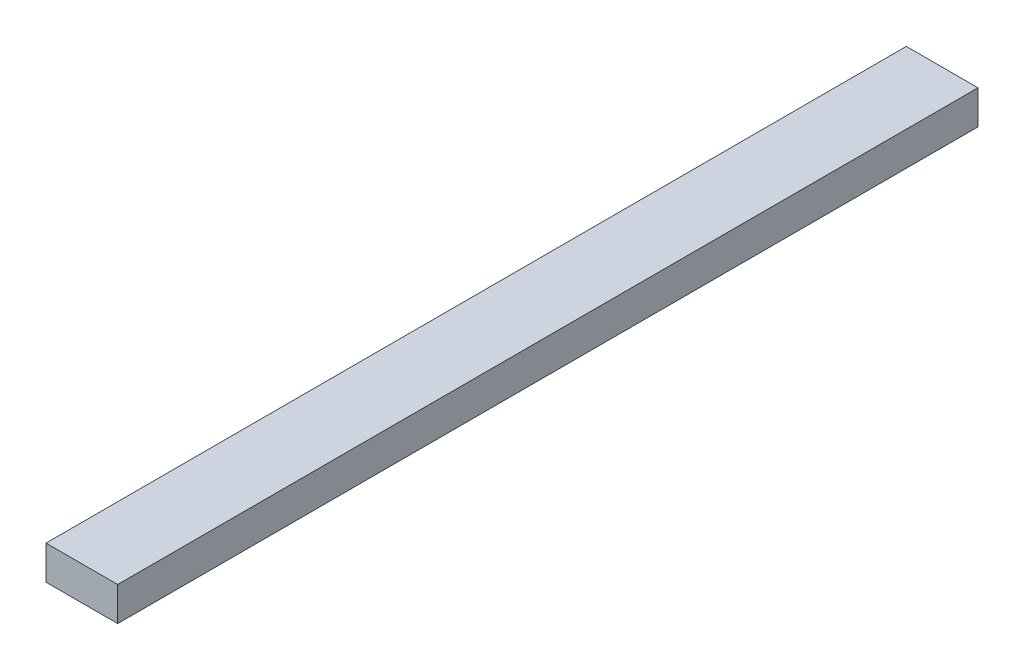
ISO-10303-21;
HEADER;
FILE_DESCRIPTION(('STEP AP214'),'2;1');
FILE_NAME('part.step','',(''),(''),'','','');
FILE_SCHEMA(('AUTOMOTIVE_DESIGN { 1 0 10303 214 1 1 1 1 }'));
ENDSEC;
DATA;
#1=APPLICATION_CONTEXT('core data for automotive mechanical design processes');
#2=APPLICATION_PROTOCOL_DEFINITION('international standard','automotive_design',2000,#1);
#3=PRODUCT_CONTEXT('',#1,'mechanical');
#4=PRODUCT('Part','Part','',(#3));
#5=PRODUCT_RELATED_PRODUCT_CATEGORY('part','',(#4));
#6=PRODUCT_DEFINITION_FORMATION('','',#4);
#7=PRODUCT_DEFINITION_CONTEXT('part definition',#1,'design');
#8=PRODUCT_DEFINITION('design','',#6,#7);
#9=PRODUCT_DEFINITION_SHAPE('','',#8);
#10=(LENGTH_UNIT() NAMED_UNIT(*) SI_UNIT(.MILLI.,.METRE.));
#11=(NAMED_UNIT(*) PLANE_ANGLE_UNIT() SI_UNIT($,.RADIAN.));
#12=(NAMED_UNIT(*) SI_UNIT($,.STERADIAN.) SOLID_ANGLE_UNIT());
#13=UNCERTAINTY_MEASURE_WITH_UNIT(LENGTH_MEASURE(1.E-05),#10,'distance_accuracy_value','');
#14=(GEOMETRIC_REPRESENTATION_CONTEXT(3) GLOBAL_UNCERTAINTY_ASSIGNED_CONTEXT((#13)) GLOBAL_UNIT_ASSIGNED_CONTEXT((#10,
#11,#12)) REPRESENTATION_CONTEXT('',''));
#15=CARTESIAN_POINT('',(0.,0.,0.));
#16=DIRECTION('',(0.,0.,1.));
#17=DIRECTION('',(1.,0.,0.));
#18=AXIS2_PLACEMENT_3D('',#15,#16,#17);
#19=CARTESIAN_POINT('',(-3.175,-1.5,76.2));
#20=DIRECTION('',(1.,0.,0.));
#21=DIRECTION('',(0.,0.,-1.));
#22=AXIS2_PLACEMENT_3D('',#19,#20,#21);
#23=PLANE('',#22);
#24=DIRECTION('',(0.,-1.,0.));
#25=VECTOR('',#24,1.);
#26=CARTESIAN_POINT('',(-3.175,-1.5,0.));
#27=LINE('',#26,#25);
#28=CARTESIAN_POINT('',(-3.175,1.5,0.));
#29=VERTEX_POINT('',#28);
#30=CARTESIAN_POINT('',(-3.175,-1.5,0.));
#31=VERTEX_POINT('',#30);
#32=EDGE_CURVE('E95',#29,#31,#27,.T.);
#33=ORIENTED_EDGE('',*,*,#32,.T.);
#34=DIRECTION('',(0.,0.,-1.));
#35=VECTOR('',#34,1.);
#36=CARTESIAN_POINT('',(-3.175,-1.5,76.2));
#37=LINE('',#36,#35);
#38=CARTESIAN_POINT('',(-3.175,-1.5,76.2));
#39=VERTEX_POINT('',#38);
#40=EDGE_CURVE('E11',#39,#31,#37,.T.);
#41=ORIENTED_EDGE('',*,*,#40,.F.);
#42=DIRECTION('',(0.,-1.,0.));
#43=VECTOR('',#42,1.);
#44=CARTESIAN_POINT('',(-3.175,-1.5,76.2));
#45=LINE('',#44,#43);
#46=CARTESIAN_POINT('',(-3.175,1.5,76.2));
#47=VERTEX_POINT('',#46);
#48=EDGE_CURVE('E83',#47,#39,#45,.T.);
#49=ORIENTED_EDGE('',*,*,#48,.F.);
#50=DIRECTION('',(0.,0.,-1.));
#51=VECTOR('',#50,1.);
#52=CARTESIAN_POINT('',(-3.175,1.5,76.2));
#53=LINE('',#52,#51);
#54=EDGE_CURVE('E91',#47,#29,#53,.T.);
#55=ORIENTED_EDGE('',*,*,#54,.T.);
#56=EDGE_LOOP('',(#33,#41,#49,#55));
#57=FACE_BOUND('',#56,.T.);
#58=ADVANCED_FACE('F32',(#57),#23,.F.);
#59=CARTESIAN_POINT('',(3.175,-1.5,76.2));
#60=DIRECTION('',(0.,1.,0.));
#61=DIRECTION('',(-1.,0.,0.));
#62=AXIS2_PLACEMENT_3D('',#59,#60,#61);
#63=PLANE('',#62);
#64=DIRECTION('',(1.,0.,0.));
#65=VECTOR('',#64,1.);
#66=CARTESIAN_POINT('',(3.175,-1.5,0.));
#67=LINE('',#66,#65);
#68=CARTESIAN_POINT('',(3.175,-1.5,0.));
#69=VERTEX_POINT('',#68);
#70=EDGE_CURVE('E87',#31,#69,#67,.T.);
#71=ORIENTED_EDGE('',*,*,#70,.T.);
#72=DIRECTION('',(0.,0.,-1.));
#73=VECTOR('',#72,1.);
#74=CARTESIAN_POINT('',(3.175,-1.5,76.2));
#75=LINE('',#74,#73);
#76=CARTESIAN_POINT('',(3.175,-1.5,76.2));
#77=VERTEX_POINT('',#76);
#78=EDGE_CURVE('E40',#77,#69,#75,.T.);
#79=ORIENTED_EDGE('',*,*,#78,.F.);
#80=DIRECTION('',(1.,0.,0.));
#81=VECTOR('',#80,1.);
#82=CARTESIAN_POINT('',(3.175,-1.5,76.2));
#83=LINE('',#82,#81);
#84=EDGE_CURVE('E78',#39,#77,#83,.T.);
#85=ORIENTED_EDGE('',*,*,#84,.F.);
#86=ORIENTED_EDGE('',*,*,#40,.T.);
#87=EDGE_LOOP('',(#71,#79,#85,#86));
#88=FACE_BOUND('',#87,.T.);
#89=ADVANCED_FACE('F86',(#88),#63,.F.);
#90=CARTESIAN_POINT('',(3.175,-1.5,76.2));
#91=DIRECTION('',(-1.,0.,0.));
#92=DIRECTION('',(0.,0.,1.));
#93=AXIS2_PLACEMENT_3D('',#90,#91,#92);
#94=PLANE('',#93);
#95=DIRECTION('',(0.,1.,0.));
#96=VECTOR('',#95,1.);
#97=CARTESIAN_POINT('',(3.175,-1.5,0.));
#98=LINE('',#97,#96);
#99=CARTESIAN_POINT('',(3.175,1.5,0.));
#100=VERTEX_POINT('',#99);
#101=EDGE_CURVE('E65',#69,#100,#98,.T.);
#102=ORIENTED_EDGE('',*,*,#101,.T.);
#103=DIRECTION('',(0.,0.,-1.));
#104=VECTOR('',#103,1.);
#105=CARTESIAN_POINT('',(3.175,1.5,76.2));
#106=LINE('',#105,#104);
#107=CARTESIAN_POINT('',(3.175,1.5,76.2));
#108=VERTEX_POINT('',#107);
#109=EDGE_CURVE('E88',#108,#100,#106,.T.);
#110=ORIENTED_EDGE('',*,*,#109,.F.);
#111=DIRECTION('',(0.,1.,0.));
#112=VECTOR('',#111,1.);
#113=CARTESIAN_POINT('',(3.175,-1.5,76.2));
#114=LINE('',#113,#112);
#115=EDGE_CURVE('E81',#77,#108,#114,.T.);
#116=ORIENTED_EDGE('',*,*,#115,.F.);
#117=ORIENTED_EDGE('',*,*,#78,.T.);
#118=EDGE_LOOP('',(#102,#110,#116,#117));
#119=FACE_BOUND('',#118,.T.);
#120=ADVANCED_FACE('F89',(#119),#94,.F.);
#121=CARTESIAN_POINT('',(3.175,1.5,76.2));
#122=DIRECTION('',(0.,-1.,0.));
#123=DIRECTION('',(1.,0.,0.));
#124=AXIS2_PLACEMENT_3D('',#121,#122,#123);
#125=PLANE('',#124);
#126=DIRECTION('',(-1.,0.,0.));
#127=VECTOR('',#126,1.);
#128=CARTESIAN_POINT('',(3.175,1.5,0.));
#129=LINE('',#128,#127);
#130=EDGE_CURVE('E71',#100,#29,#129,.T.);
#131=ORIENTED_EDGE('',*,*,#130,.T.);
#132=ORIENTED_EDGE('',*,*,#54,.F.);
#133=DIRECTION('',(-1.,0.,0.));
#134=VECTOR('',#133,1.);
#135=CARTESIAN_POINT('',(3.175,1.5,76.2));
#136=LINE('',#135,#134);
#137=EDGE_CURVE('E48',#108,#47,#136,.T.);
#138=ORIENTED_EDGE('',*,*,#137,.F.);
#139=ORIENTED_EDGE('',*,*,#109,.T.);
#140=EDGE_LOOP('',(#131,#132,#138,#139));
#141=FACE_BOUND('',#140,.T.);
#142=ADVANCED_FACE('F102',(#141),#125,.F.);
#143=CARTESIAN_POINT('',(0.,0.,76.2));
#144=DIRECTION('',(0.,0.,1.));
#145=DIRECTION('',(1.,0.,0.));
#146=AXIS2_PLACEMENT_3D('',#143,#144,#145);
#147=PLANE('',#146);
#148=ORIENTED_EDGE('',*,*,#48,.T.);
#149=ORIENTED_EDGE('',*,*,#84,.T.);
#150=ORIENTED_EDGE('',*,*,#115,.T.);
#151=ORIENTED_EDGE('',*,*,#137,.T.);
#152=EDGE_LOOP('',(#148,#149,#150,#151));
#153=FACE_BOUND('',#152,.T.);
#154=ADVANCED_FACE('F79',(#153),#147,.T.);
#155=CARTESIAN_POINT('',(0.,0.,0.));
#156=DIRECTION('',(0.,0.,1.));
#157=DIRECTION('',(1.,0.,0.));
#158=AXIS2_PLACEMENT_3D('',#155,#156,#157);
#159=PLANE('',#158);
#160=ORIENTED_EDGE('',*,*,#32,.F.);
#161=ORIENTED_EDGE('',*,*,#130,.F.);
#162=ORIENTED_EDGE('',*,*,#101,.F.);
#163=ORIENTED_EDGE('',*,*,#70,.F.);
#164=EDGE_LOOP('',(#160,#161,#162,#163));
#165=FACE_BOUND('',#164,.T.);
#166=ADVANCED_FACE('F105',(#165),#159,.F.);
#167=CLOSED_SHELL('',(#58,#89,#120,#142,#154,#166));
#168=MANIFOLD_SOLID_BREP('B2',#167);
#169=ADVANCED_BREP_SHAPE_REPRESENTATION('',(#18,#168),#14);
#170=SHAPE_DEFINITION_REPRESENTATION(#9,#169);
ENDSEC;
END-ISO-10303-21;
